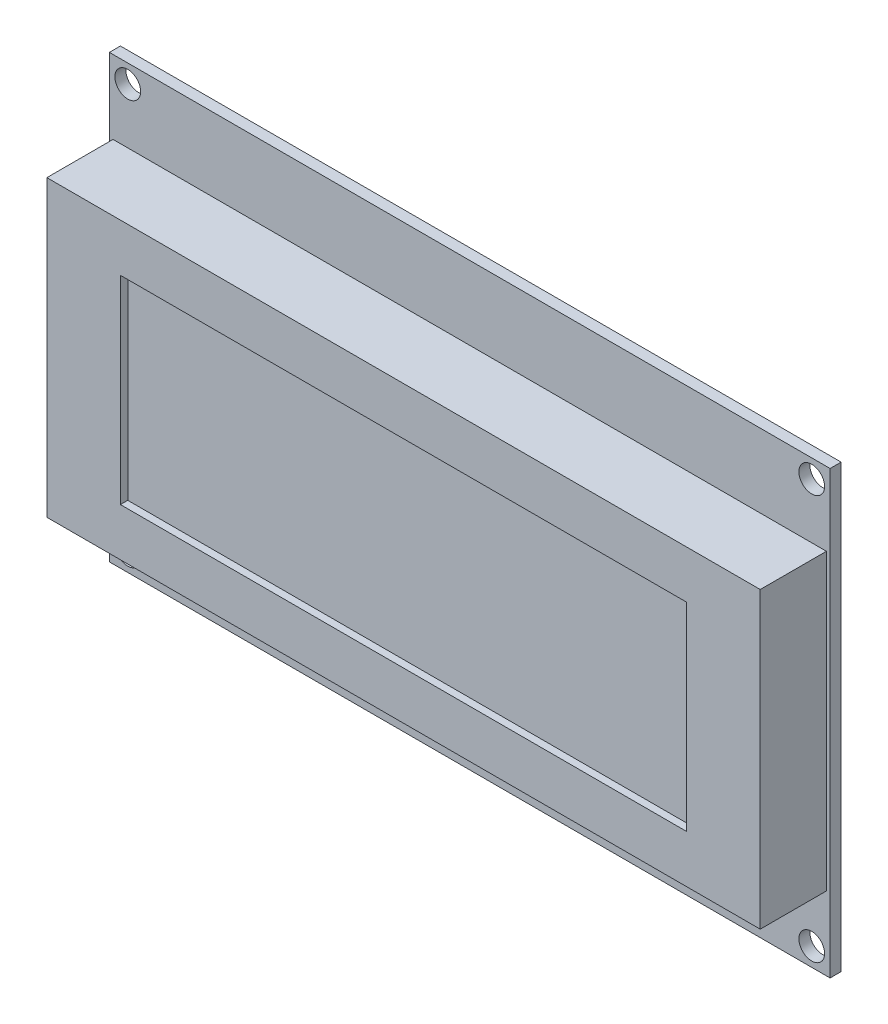
ISO-10303-21;
HEADER;
FILE_DESCRIPTION(('STEP AP214'),'2;1');
FILE_NAME('part.step','',(''),(''),'','','');
FILE_SCHEMA(('AUTOMOTIVE_DESIGN { 1 0 10303 214 1 1 1 1 }'));
ENDSEC;
DATA;
#1=APPLICATION_CONTEXT('core data for automotive mechanical design processes');
#2=APPLICATION_PROTOCOL_DEFINITION('international standard','automotive_design',2000,#1);
#3=PRODUCT_CONTEXT('',#1,'mechanical');
#4=PRODUCT('Part','Part','',(#3));
#5=PRODUCT_RELATED_PRODUCT_CATEGORY('part','',(#4));
#6=PRODUCT_DEFINITION_FORMATION('','',#4);
#7=PRODUCT_DEFINITION_CONTEXT('part definition',#1,'design');
#8=PRODUCT_DEFINITION('design','',#6,#7);
#9=PRODUCT_DEFINITION_SHAPE('','',#8);
#10=(LENGTH_UNIT() NAMED_UNIT(*) SI_UNIT(.MILLI.,.METRE.));
#11=(NAMED_UNIT(*) PLANE_ANGLE_UNIT() SI_UNIT($,.RADIAN.));
#12=(NAMED_UNIT(*) SI_UNIT($,.STERADIAN.) SOLID_ANGLE_UNIT());
#13=UNCERTAINTY_MEASURE_WITH_UNIT(LENGTH_MEASURE(1.E-05),#10,'distance_accuracy_value','');
#14=(GEOMETRIC_REPRESENTATION_CONTEXT(3) GLOBAL_UNCERTAINTY_ASSIGNED_CONTEXT((#13)) GLOBAL_UNIT_ASSIGNED_CONTEXT((#10,
#11,#12)) REPRESENTATION_CONTEXT('',''));
#15=CARTESIAN_POINT('',(0.,0.,0.));
#16=DIRECTION('',(0.,0.,1.));
#17=DIRECTION('',(1.,0.,0.));
#18=AXIS2_PLACEMENT_3D('',#15,#16,#17);
#19=CARTESIAN_POINT('',(49.,30.,1.5));
#20=DIRECTION('',(-1.,0.,0.));
#21=DIRECTION('',(0.,-1.,0.));
#22=AXIS2_PLACEMENT_3D('',#19,#20,#21);
#23=PLANE('',#22);
#24=DIRECTION('',(0.,0.,-1.));
#25=VECTOR('',#24,1.);
#26=CARTESIAN_POINT('',(49.,30.,1.5));
#27=LINE('',#26,#25);
#28=CARTESIAN_POINT('',(49.,30.,1.5));
#29=VERTEX_POINT('',#28);
#30=CARTESIAN_POINT('',(49.,30.,0.));
#31=VERTEX_POINT('',#30);
#32=EDGE_CURVE('E206',#29,#31,#27,.T.);
#33=ORIENTED_EDGE('',*,*,#32,.F.);
#34=DIRECTION('',(0.,1.,0.));
#35=VECTOR('',#34,1.);
#36=CARTESIAN_POINT('',(49.,30.,1.5));
#37=LINE('',#36,#35);
#38=CARTESIAN_POINT('',(49.,-30.,1.5));
#39=VERTEX_POINT('',#38);
#40=EDGE_CURVE('E180',#39,#29,#37,.T.);
#41=ORIENTED_EDGE('',*,*,#40,.F.);
#42=DIRECTION('',(0.,0.,-1.));
#43=VECTOR('',#42,1.);
#44=CARTESIAN_POINT('',(49.,-30.,1.5));
#45=LINE('',#44,#43);
#46=CARTESIAN_POINT('',(49.,-30.,0.));
#47=VERTEX_POINT('',#46);
#48=EDGE_CURVE('E189',#39,#47,#45,.T.);
#49=ORIENTED_EDGE('',*,*,#48,.T.);
#50=DIRECTION('',(0.,1.,0.));
#51=VECTOR('',#50,1.);
#52=CARTESIAN_POINT('',(49.,30.,0.));
#53=LINE('',#52,#51);
#54=EDGE_CURVE('E190',#47,#31,#53,.T.);
#55=ORIENTED_EDGE('',*,*,#54,.T.);
#56=EDGE_LOOP('',(#33,#41,#49,#55));
#57=FACE_BOUND('',#56,.T.);
#58=ADVANCED_FACE('F39',(#57),#23,.F.);
#59=CARTESIAN_POINT('',(-49.,30.,1.5));
#60=DIRECTION('',(1.,0.,0.));
#61=DIRECTION('',(0.,0.,-1.));
#62=AXIS2_PLACEMENT_3D('',#59,#60,#61);
#63=PLANE('',#62);
#64=DIRECTION('',(0.,0.,-1.));
#65=VECTOR('',#64,1.);
#66=CARTESIAN_POINT('',(-49.,-30.,1.5));
#67=LINE('',#66,#65);
#68=CARTESIAN_POINT('',(-49.,-30.,1.5));
#69=VERTEX_POINT('',#68);
#70=CARTESIAN_POINT('',(-49.,-30.,0.));
#71=VERTEX_POINT('',#70);
#72=EDGE_CURVE('E200',#69,#71,#67,.T.);
#73=ORIENTED_EDGE('',*,*,#72,.F.);
#74=DIRECTION('',(0.,-1.,0.));
#75=VECTOR('',#74,1.);
#76=CARTESIAN_POINT('',(-49.,30.,1.5));
#77=LINE('',#76,#75);
#78=CARTESIAN_POINT('',(-49.,30.,1.5));
#79=VERTEX_POINT('',#78);
#80=EDGE_CURVE('E185',#79,#69,#77,.T.);
#81=ORIENTED_EDGE('',*,*,#80,.F.);
#82=DIRECTION('',(0.,0.,-1.));
#83=VECTOR('',#82,1.);
#84=CARTESIAN_POINT('',(-49.,30.,1.5));
#85=LINE('',#84,#83);
#86=CARTESIAN_POINT('',(-49.,30.,0.));
#87=VERTEX_POINT('',#86);
#88=EDGE_CURVE('E203',#79,#87,#85,.T.);
#89=ORIENTED_EDGE('',*,*,#88,.T.);
#90=DIRECTION('',(0.,-1.,0.));
#91=VECTOR('',#90,1.);
#92=CARTESIAN_POINT('',(-49.,30.,0.));
#93=LINE('',#92,#91);
#94=EDGE_CURVE('E195',#87,#71,#93,.T.);
#95=ORIENTED_EDGE('',*,*,#94,.T.);
#96=EDGE_LOOP('',(#73,#81,#89,#95));
#97=FACE_BOUND('',#96,.T.);
#98=ADVANCED_FACE('F314',(#97),#63,.F.);
#99=CARTESIAN_POINT('',(0.,0.,0.));
#100=DIRECTION('',(0.,0.,1.));
#101=DIRECTION('',(1.,0.,0.));
#102=AXIS2_PLACEMENT_3D('',#99,#100,#101);
#103=PLANE('',#102);
#104=ORIENTED_EDGE('',*,*,#54,.F.);
#105=DIRECTION('',(1.,0.,0.));
#106=VECTOR('',#105,1.);
#107=CARTESIAN_POINT('',(-49.,-30.,0.));
#108=LINE('',#107,#106);
#109=EDGE_CURVE('E183',#71,#47,#108,.T.);
#110=ORIENTED_EDGE('',*,*,#109,.F.);
#111=ORIENTED_EDGE('',*,*,#94,.F.);
#112=DIRECTION('',(-1.,0.,0.));
#113=VECTOR('',#112,1.);
#114=CARTESIAN_POINT('',(-49.,30.,0.));
#115=LINE('',#114,#113);
#116=EDGE_CURVE('E193',#31,#87,#115,.T.);
#117=ORIENTED_EDGE('',*,*,#116,.F.);
#118=EDGE_LOOP('',(#104,#110,#111,#117));
#119=FACE_BOUND('',#118,.T.);
#120=CARTESIAN_POINT('',(-46.5,27.5,0.));
#121=DIRECTION('',(0.,0.,1.));
#122=DIRECTION('',(1.,0.,0.));
#123=AXIS2_PLACEMENT_3D('',#120,#121,#122);
#124=CIRCLE('',#123,1.75);
#125=CARTESIAN_POINT('',(-44.75,27.5,0.));
#126=VERTEX_POINT('',#125);
#127=EDGE_CURVE('E235',#126,#126,#124,.T.);
#128=ORIENTED_EDGE('',*,*,#127,.T.);
#129=EDGE_LOOP('',(#128));
#130=FACE_BOUND('',#129,.T.);
#131=CARTESIAN_POINT('',(46.5,27.5,0.));
#132=DIRECTION('',(0.,0.,1.));
#133=DIRECTION('',(1.,0.,0.));
#134=AXIS2_PLACEMENT_3D('',#131,#132,#133);
#135=CIRCLE('',#134,1.75000000000001);
#136=CARTESIAN_POINT('',(48.25,27.5,0.));
#137=VERTEX_POINT('',#136);
#138=EDGE_CURVE('E249',#137,#137,#135,.T.);
#139=ORIENTED_EDGE('',*,*,#138,.T.);
#140=EDGE_LOOP('',(#139));
#141=FACE_BOUND('',#140,.T.);
#142=CARTESIAN_POINT('',(46.5,-27.5,0.));
#143=DIRECTION('',(0.,0.,1.));
#144=DIRECTION('',(1.,0.,0.));
#145=AXIS2_PLACEMENT_3D('',#142,#143,#144);
#146=CIRCLE('',#145,1.75);
#147=CARTESIAN_POINT('',(48.25,-27.5,0.));
#148=VERTEX_POINT('',#147);
#149=EDGE_CURVE('E262',#148,#148,#146,.T.);
#150=ORIENTED_EDGE('',*,*,#149,.T.);
#151=EDGE_LOOP('',(#150));
#152=FACE_BOUND('',#151,.T.);
#153=CARTESIAN_POINT('',(-46.5,-27.5,0.));
#154=DIRECTION('',(0.,0.,1.));
#155=DIRECTION('',(1.,0.,0.));
#156=AXIS2_PLACEMENT_3D('',#153,#154,#155);
#157=CIRCLE('',#156,1.75);
#158=CARTESIAN_POINT('',(-44.75,-27.5,0.));
#159=VERTEX_POINT('',#158);
#160=EDGE_CURVE('E255',#159,#159,#157,.T.);
#161=ORIENTED_EDGE('',*,*,#160,.T.);
#162=EDGE_LOOP('',(#161));
#163=FACE_BOUND('',#162,.T.);
#164=DIRECTION('',(0.,-1.,0.));
#165=VECTOR('',#164,1.);
#166=CARTESIAN_POINT('',(40.,-28.,0.));
#167=LINE('',#166,#165);
#168=CARTESIAN_POINT('',(40.,-8.,0.));
#169=VERTEX_POINT('',#168);
#170=CARTESIAN_POINT('',(40.,-28.,0.));
#171=VERTEX_POINT('',#170);
#172=EDGE_CURVE('E292',#169,#171,#167,.T.);
#173=ORIENTED_EDGE('',*,*,#172,.F.);
#174=DIRECTION('',(1.,0.,0.));
#175=VECTOR('',#174,1.);
#176=CARTESIAN_POINT('',(40.,-8.,0.));
#177=LINE('',#176,#175);
#178=CARTESIAN_POINT('',(-1.99999999999999,-8.,0.));
#179=VERTEX_POINT('',#178);
#180=EDGE_CURVE('E282',#179,#169,#177,.T.);
#181=ORIENTED_EDGE('',*,*,#180,.F.);
#182=DIRECTION('',(0.,1.,0.));
#183=VECTOR('',#182,1.);
#184=CARTESIAN_POINT('',(-1.99999999999999,-28.,0.));
#185=LINE('',#184,#183);
#186=CARTESIAN_POINT('',(-1.99999999999999,-28.,0.));
#187=VERTEX_POINT('',#186);
#188=EDGE_CURVE('E286',#187,#179,#185,.T.);
#189=ORIENTED_EDGE('',*,*,#188,.F.);
#190=DIRECTION('',(-1.,0.,0.));
#191=VECTOR('',#190,1.);
#192=CARTESIAN_POINT('',(40.,-28.,0.));
#193=LINE('',#192,#191);
#194=EDGE_CURVE('E289',#171,#187,#193,.T.);
#195=ORIENTED_EDGE('',*,*,#194,.F.);
#196=EDGE_LOOP('',(#173,#181,#189,#195));
#197=FACE_BOUND('',#196,.T.);
#198=ADVANCED_FACE('F319',(#119,#130,#141,#152,#163,#197),#103,.F.);
#199=CARTESIAN_POINT('',(-49.,30.,1.5));
#200=DIRECTION('',(0.,-1.,0.));
#201=DIRECTION('',(0.,0.,-1.));
#202=AXIS2_PLACEMENT_3D('',#199,#200,#201);
#203=PLANE('',#202);
#204=ORIENTED_EDGE('',*,*,#116,.T.);
#205=ORIENTED_EDGE('',*,*,#88,.F.);
#206=DIRECTION('',(-1.,0.,0.));
#207=VECTOR('',#206,1.);
#208=CARTESIAN_POINT('',(-49.,30.,1.5));
#209=LINE('',#208,#207);
#210=EDGE_CURVE('E182',#29,#79,#209,.T.);
#211=ORIENTED_EDGE('',*,*,#210,.F.);
#212=ORIENTED_EDGE('',*,*,#32,.T.);
#213=EDGE_LOOP('',(#204,#205,#211,#212));
#214=FACE_BOUND('',#213,.T.);
#215=ADVANCED_FACE('F327',(#214),#203,.F.);
#216=CARTESIAN_POINT('',(-49.,-30.,1.5));
#217=DIRECTION('',(0.,1.,0.));
#218=DIRECTION('',(0.,0.,1.));
#219=AXIS2_PLACEMENT_3D('',#216,#217,#218);
#220=PLANE('',#219);
#221=ORIENTED_EDGE('',*,*,#109,.T.);
#222=ORIENTED_EDGE('',*,*,#48,.F.);
#223=DIRECTION('',(1.,0.,0.));
#224=VECTOR('',#223,1.);
#225=CARTESIAN_POINT('',(-49.,-30.,1.5));
#226=LINE('',#225,#224);
#227=EDGE_CURVE('E187',#69,#39,#226,.T.);
#228=ORIENTED_EDGE('',*,*,#227,.F.);
#229=ORIENTED_EDGE('',*,*,#72,.T.);
#230=EDGE_LOOP('',(#221,#222,#228,#229));
#231=FACE_BOUND('',#230,.T.);
#232=ADVANCED_FACE('F335',(#231),#220,.F.);
#233=CARTESIAN_POINT('',(0.,0.,1.5));
#234=DIRECTION('',(0.,0.,1.));
#235=DIRECTION('',(1.,0.,0.));
#236=AXIS2_PLACEMENT_3D('',#233,#234,#235);
#237=PLANE('',#236);
#238=ORIENTED_EDGE('',*,*,#80,.T.);
#239=ORIENTED_EDGE('',*,*,#227,.T.);
#240=ORIENTED_EDGE('',*,*,#40,.T.);
#241=ORIENTED_EDGE('',*,*,#210,.T.);
#242=EDGE_LOOP('',(#238,#239,#240,#241));
#243=FACE_BOUND('',#242,.T.);
#244=DIRECTION('',(-1.,0.,0.));
#245=VECTOR('',#244,1.);
#246=CARTESIAN_POINT('',(-49.,20.,1.5));
#247=LINE('',#246,#245);
#248=CARTESIAN_POINT('',(48.5,20.,1.5));
#249=VERTEX_POINT('',#248);
#250=CARTESIAN_POINT('',(-48.5,20.,1.5));
#251=VERTEX_POINT('',#250);
#252=EDGE_CURVE('E166',#249,#251,#247,.T.);
#253=ORIENTED_EDGE('',*,*,#252,.F.);
#254=DIRECTION('',(0.,1.,0.));
#255=VECTOR('',#254,1.);
#256=CARTESIAN_POINT('',(48.5,-22.8772475942832,1.5));
#257=LINE('',#256,#255);
#258=CARTESIAN_POINT('',(48.5,-20.,1.5));
#259=VERTEX_POINT('',#258);
#260=EDGE_CURVE('E151',#259,#249,#257,.T.);
#261=ORIENTED_EDGE('',*,*,#260,.F.);
#262=DIRECTION('',(1.,0.,0.));
#263=VECTOR('',#262,1.);
#264=CARTESIAN_POINT('',(-49.,-20.,1.5));
#265=LINE('',#264,#263);
#266=CARTESIAN_POINT('',(-48.5,-20.,1.5));
#267=VERTEX_POINT('',#266);
#268=EDGE_CURVE('E164',#267,#259,#265,.T.);
#269=ORIENTED_EDGE('',*,*,#268,.F.);
#270=DIRECTION('',(0.,-1.,0.));
#271=VECTOR('',#270,1.);
#272=CARTESIAN_POINT('',(-48.5,-21.5579745302687,1.5));
#273=LINE('',#272,#271);
#274=EDGE_CURVE('E167',#251,#267,#273,.T.);
#275=ORIENTED_EDGE('',*,*,#274,.F.);
#276=EDGE_LOOP('',(#253,#261,#269,#275));
#277=FACE_BOUND('',#276,.T.);
#278=CARTESIAN_POINT('',(-46.5,-27.5,1.5));
#279=DIRECTION('',(0.,0.,1.));
#280=DIRECTION('',(1.,0.,0.));
#281=AXIS2_PLACEMENT_3D('',#278,#279,#280);
#282=CIRCLE('',#281,1.75);
#283=CARTESIAN_POINT('',(-44.75,-27.5,1.5));
#284=VERTEX_POINT('',#283);
#285=EDGE_CURVE('E252',#284,#284,#282,.T.);
#286=ORIENTED_EDGE('',*,*,#285,.F.);
#287=EDGE_LOOP('',(#286));
#288=FACE_BOUND('',#287,.T.);
#289=CARTESIAN_POINT('',(46.5,-27.5,1.5));
#290=DIRECTION('',(0.,0.,1.));
#291=DIRECTION('',(1.,0.,0.));
#292=AXIS2_PLACEMENT_3D('',#289,#290,#291);
#293=CIRCLE('',#292,1.75);
#294=CARTESIAN_POINT('',(48.25,-27.5,1.5));
#295=VERTEX_POINT('',#294);
#296=EDGE_CURVE('E259',#295,#295,#293,.T.);
#297=ORIENTED_EDGE('',*,*,#296,.F.);
#298=EDGE_LOOP('',(#297));
#299=FACE_BOUND('',#298,.T.);
#300=CARTESIAN_POINT('',(46.5,27.5,1.5));
#301=DIRECTION('',(0.,0.,1.));
#302=DIRECTION('',(1.,0.,0.));
#303=AXIS2_PLACEMENT_3D('',#300,#301,#302);
#304=CIRCLE('',#303,1.75000000000001);
#305=CARTESIAN_POINT('',(48.25,27.5,1.5));
#306=VERTEX_POINT('',#305);
#307=EDGE_CURVE('E265',#306,#306,#304,.T.);
#308=ORIENTED_EDGE('',*,*,#307,.F.);
#309=EDGE_LOOP('',(#308));
#310=FACE_BOUND('',#309,.T.);
#311=CARTESIAN_POINT('',(-46.5,27.5,1.5));
#312=DIRECTION('',(0.,0.,1.));
#313=DIRECTION('',(1.,0.,0.));
#314=AXIS2_PLACEMENT_3D('',#311,#312,#313);
#315=CIRCLE('',#314,1.75);
#316=CARTESIAN_POINT('',(-44.75,27.5,1.5));
#317=VERTEX_POINT('',#316);
#318=EDGE_CURVE('E246',#317,#317,#315,.T.);
#319=ORIENTED_EDGE('',*,*,#318,.F.);
#320=EDGE_LOOP('',(#319));
#321=FACE_BOUND('',#320,.T.);
#322=ADVANCED_FACE('F161',(#243,#277,#288,#299,#310,#321),#237,.T.);
#323=CARTESIAN_POINT('',(-49.,-20.,10.5));
#324=DIRECTION('',(0.,1.,0.));
#325=DIRECTION('',(-1.,0.,0.));
#326=AXIS2_PLACEMENT_3D('',#323,#324,#325);
#327=PLANE('',#326);
#328=DIRECTION('',(1.,0.,0.));
#329=VECTOR('',#328,1.);
#330=CARTESIAN_POINT('',(-49.,-20.,10.5));
#331=LINE('',#330,#329);
#332=CARTESIAN_POINT('',(-48.5,-20.,10.5));
#333=VERTEX_POINT('',#332);
#334=CARTESIAN_POINT('',(48.5,-20.,10.5));
#335=VERTEX_POINT('',#334);
#336=EDGE_CURVE('E172',#333,#335,#331,.T.);
#337=ORIENTED_EDGE('',*,*,#336,.F.);
#338=DIRECTION('',(0.,0.,-1.));
#339=VECTOR('',#338,1.);
#340=CARTESIAN_POINT('',(-48.5,-20.,10.5));
#341=LINE('',#340,#339);
#342=EDGE_CURVE('E61',#333,#267,#341,.T.);
#343=ORIENTED_EDGE('',*,*,#342,.T.);
#344=ORIENTED_EDGE('',*,*,#268,.T.);
#345=DIRECTION('',(0.,0.,1.));
#346=VECTOR('',#345,1.);
#347=CARTESIAN_POINT('',(48.5,-20.,10.5));
#348=LINE('',#347,#346);
#349=EDGE_CURVE('E148',#259,#335,#348,.T.);
#350=ORIENTED_EDGE('',*,*,#349,.T.);
#351=EDGE_LOOP('',(#337,#343,#344,#350));
#352=FACE_BOUND('',#351,.T.);
#353=ADVANCED_FACE('F169',(#352),#327,.F.);
#354=CARTESIAN_POINT('',(-49.,20.,10.5));
#355=DIRECTION('',(0.,-1.,0.));
#356=DIRECTION('',(0.,0.,-1.));
#357=AXIS2_PLACEMENT_3D('',#354,#355,#356);
#358=PLANE('',#357);
#359=ORIENTED_EDGE('',*,*,#252,.T.);
#360=DIRECTION('',(0.,0.,1.));
#361=VECTOR('',#360,1.);
#362=CARTESIAN_POINT('',(-48.5,20.,10.5));
#363=LINE('',#362,#361);
#364=CARTESIAN_POINT('',(-48.5,20.,10.5));
#365=VERTEX_POINT('',#364);
#366=EDGE_CURVE('E156',#251,#365,#363,.T.);
#367=ORIENTED_EDGE('',*,*,#366,.T.);
#368=DIRECTION('',(-1.,0.,0.));
#369=VECTOR('',#368,1.);
#370=CARTESIAN_POINT('',(-49.,20.,10.5));
#371=LINE('',#370,#369);
#372=CARTESIAN_POINT('',(48.5,20.,10.5));
#373=VERTEX_POINT('',#372);
#374=EDGE_CURVE('E177',#373,#365,#371,.T.);
#375=ORIENTED_EDGE('',*,*,#374,.F.);
#376=DIRECTION('',(0.,0.,-1.));
#377=VECTOR('',#376,1.);
#378=CARTESIAN_POINT('',(48.5,20.,10.5));
#379=LINE('',#378,#377);
#380=EDGE_CURVE('E53',#373,#249,#379,.T.);
#381=ORIENTED_EDGE('',*,*,#380,.T.);
#382=EDGE_LOOP('',(#359,#367,#375,#381));
#383=FACE_BOUND('',#382,.T.);
#384=ADVANCED_FACE('F214',(#383),#358,.F.);
#385=CARTESIAN_POINT('',(0.,0.,10.5));
#386=DIRECTION('',(0.,0.,-1.));
#387=DIRECTION('',(-1.,0.,0.));
#388=AXIS2_PLACEMENT_3D('',#385,#386,#387);
#389=PLANE('',#388);
#390=DIRECTION('',(-1.,0.,0.));
#391=VECTOR('',#390,1.);
#392=CARTESIAN_POINT('',(-38.5,13.5,10.5));
#393=LINE('',#392,#391);
#394=CARTESIAN_POINT('',(38.5,13.5,10.5));
#395=VERTEX_POINT('',#394);
#396=CARTESIAN_POINT('',(-38.5,13.5,10.5));
#397=VERTEX_POINT('',#396);
#398=EDGE_CURVE('E230',#395,#397,#393,.T.);
#399=ORIENTED_EDGE('',*,*,#398,.F.);
#400=DIRECTION('',(0.,1.,0.));
#401=VECTOR('',#400,1.);
#402=CARTESIAN_POINT('',(38.5,13.5,10.5));
#403=LINE('',#402,#401);
#404=CARTESIAN_POINT('',(38.5,-13.5,10.5));
#405=VERTEX_POINT('',#404);
#406=EDGE_CURVE('E233',#405,#395,#403,.T.);
#407=ORIENTED_EDGE('',*,*,#406,.F.);
#408=DIRECTION('',(1.,0.,0.));
#409=VECTOR('',#408,1.);
#410=CARTESIAN_POINT('',(-38.5,-13.5,10.5));
#411=LINE('',#410,#409);
#412=CARTESIAN_POINT('',(-38.5,-13.5,10.5));
#413=VERTEX_POINT('',#412);
#414=EDGE_CURVE('E223',#413,#405,#411,.T.);
#415=ORIENTED_EDGE('',*,*,#414,.F.);
#416=DIRECTION('',(0.,-1.,0.));
#417=VECTOR('',#416,1.);
#418=CARTESIAN_POINT('',(-38.5,13.5,10.5));
#419=LINE('',#418,#417);
#420=EDGE_CURVE('E227',#397,#413,#419,.T.);
#421=ORIENTED_EDGE('',*,*,#420,.F.);
#422=EDGE_LOOP('',(#399,#407,#415,#421));
#423=FACE_BOUND('',#422,.T.);
#424=ORIENTED_EDGE('',*,*,#374,.T.);
#425=DIRECTION('',(0.,-1.,0.));
#426=VECTOR('',#425,1.);
#427=CARTESIAN_POINT('',(-48.5,0.,10.5));
#428=LINE('',#427,#426);
#429=EDGE_CURVE('E11',#365,#333,#428,.T.);
#430=ORIENTED_EDGE('',*,*,#429,.T.);
#431=ORIENTED_EDGE('',*,*,#336,.T.);
#432=DIRECTION('',(0.,1.,0.));
#433=VECTOR('',#432,1.);
#434=CARTESIAN_POINT('',(48.5,0.,10.5));
#435=LINE('',#434,#433);
#436=EDGE_CURVE('E46',#335,#373,#435,.T.);
#437=ORIENTED_EDGE('',*,*,#436,.T.);
#438=EDGE_LOOP('',(#424,#430,#431,#437));
#439=FACE_BOUND('',#438,.T.);
#440=ADVANCED_FACE('F211',(#423,#439),#389,.F.);
#441=CARTESIAN_POINT('',(38.5,13.5,9.5));
#442=DIRECTION('',(1.,0.,0.));
#443=DIRECTION('',(0.,0.,-1.));
#444=AXIS2_PLACEMENT_3D('',#441,#442,#443);
#445=PLANE('',#444);
#446=ORIENTED_EDGE('',*,*,#406,.T.);
#447=DIRECTION('',(0.,0.,1.));
#448=VECTOR('',#447,1.);
#449=CARTESIAN_POINT('',(38.5,13.5,9.5));
#450=LINE('',#449,#448);
#451=CARTESIAN_POINT('',(38.5,13.5,9.5));
#452=VERTEX_POINT('',#451);
#453=EDGE_CURVE('E216',#452,#395,#450,.T.);
#454=ORIENTED_EDGE('',*,*,#453,.F.);
#455=DIRECTION('',(0.,1.,0.));
#456=VECTOR('',#455,1.);
#457=CARTESIAN_POINT('',(38.5,13.5,9.5));
#458=LINE('',#457,#456);
#459=CARTESIAN_POINT('',(38.5,-13.5,9.5));
#460=VERTEX_POINT('',#459);
#461=EDGE_CURVE('E226',#460,#452,#458,.T.);
#462=ORIENTED_EDGE('',*,*,#461,.F.);
#463=DIRECTION('',(0.,0.,1.));
#464=VECTOR('',#463,1.);
#465=CARTESIAN_POINT('',(38.5,-13.5,9.5));
#466=LINE('',#465,#464);
#467=EDGE_CURVE('E170',#460,#405,#466,.T.);
#468=ORIENTED_EDGE('',*,*,#467,.T.);
#469=EDGE_LOOP('',(#446,#454,#462,#468));
#470=FACE_BOUND('',#469,.T.);
#471=ADVANCED_FACE('F401',(#470),#445,.F.);
#472=CARTESIAN_POINT('',(-38.5,-13.5,9.5));
#473=DIRECTION('',(0.,-1.,0.));
#474=DIRECTION('',(0.,0.,-1.));
#475=AXIS2_PLACEMENT_3D('',#472,#473,#474);
#476=PLANE('',#475);
#477=ORIENTED_EDGE('',*,*,#414,.T.);
#478=ORIENTED_EDGE('',*,*,#467,.F.);
#479=DIRECTION('',(1.,0.,0.));
#480=VECTOR('',#479,1.);
#481=CARTESIAN_POINT('',(-38.5,-13.5,9.5));
#482=LINE('',#481,#480);
#483=CARTESIAN_POINT('',(-38.5,-13.5,9.5));
#484=VERTEX_POINT('',#483);
#485=EDGE_CURVE('E220',#484,#460,#482,.T.);
#486=ORIENTED_EDGE('',*,*,#485,.F.);
#487=DIRECTION('',(0.,0.,1.));
#488=VECTOR('',#487,1.);
#489=CARTESIAN_POINT('',(-38.5,-13.5,9.5));
#490=LINE('',#489,#488);
#491=EDGE_CURVE('E174',#484,#413,#490,.T.);
#492=ORIENTED_EDGE('',*,*,#491,.T.);
#493=EDGE_LOOP('',(#477,#478,#486,#492));
#494=FACE_BOUND('',#493,.T.);
#495=ADVANCED_FACE('F397',(#494),#476,.F.);
#496=CARTESIAN_POINT('',(-38.5,13.5,9.5));
#497=DIRECTION('',(-1.,0.,0.));
#498=DIRECTION('',(0.,0.,1.));
#499=AXIS2_PLACEMENT_3D('',#496,#497,#498);
#500=PLANE('',#499);
#501=ORIENTED_EDGE('',*,*,#420,.T.);
#502=ORIENTED_EDGE('',*,*,#491,.F.);
#503=DIRECTION('',(0.,-1.,0.));
#504=VECTOR('',#503,1.);
#505=CARTESIAN_POINT('',(-38.5,13.5,9.5));
#506=LINE('',#505,#504);
#507=CARTESIAN_POINT('',(-38.5,13.5,9.5));
#508=VERTEX_POINT('',#507);
#509=EDGE_CURVE('E238',#508,#484,#506,.T.);
#510=ORIENTED_EDGE('',*,*,#509,.F.);
#511=DIRECTION('',(0.,0.,1.));
#512=VECTOR('',#511,1.);
#513=CARTESIAN_POINT('',(-38.5,13.5,9.5));
#514=LINE('',#513,#512);
#515=EDGE_CURVE('E219',#508,#397,#514,.T.);
#516=ORIENTED_EDGE('',*,*,#515,.T.);
#517=EDGE_LOOP('',(#501,#502,#510,#516));
#518=FACE_BOUND('',#517,.T.);
#519=ADVANCED_FACE('F400',(#518),#500,.F.);
#520=CARTESIAN_POINT('',(-38.5,13.5,9.5));
#521=DIRECTION('',(0.,1.,0.));
#522=DIRECTION('',(0.,0.,1.));
#523=AXIS2_PLACEMENT_3D('',#520,#521,#522);
#524=PLANE('',#523);
#525=ORIENTED_EDGE('',*,*,#398,.T.);
#526=ORIENTED_EDGE('',*,*,#515,.F.);
#527=DIRECTION('',(-1.,0.,0.));
#528=VECTOR('',#527,1.);
#529=CARTESIAN_POINT('',(-38.5,13.5,9.5));
#530=LINE('',#529,#528);
#531=EDGE_CURVE('E241',#452,#508,#530,.T.);
#532=ORIENTED_EDGE('',*,*,#531,.F.);
#533=ORIENTED_EDGE('',*,*,#453,.T.);
#534=EDGE_LOOP('',(#525,#526,#532,#533));
#535=FACE_BOUND('',#534,.T.);
#536=ADVANCED_FACE('F395',(#535),#524,.F.);
#537=CARTESIAN_POINT('',(0.,0.,9.5));
#538=DIRECTION('',(0.,0.,1.));
#539=DIRECTION('',(1.,0.,0.));
#540=AXIS2_PLACEMENT_3D('',#537,#538,#539);
#541=PLANE('',#540);
#542=ORIENTED_EDGE('',*,*,#461,.T.);
#543=ORIENTED_EDGE('',*,*,#531,.T.);
#544=ORIENTED_EDGE('',*,*,#509,.T.);
#545=ORIENTED_EDGE('',*,*,#485,.T.);
#546=EDGE_LOOP('',(#542,#543,#544,#545));
#547=FACE_BOUND('',#546,.T.);
#548=ADVANCED_FACE('F391',(#547),#541,.T.);
#549=CARTESIAN_POINT('',(-46.5,27.5,0.));
#550=DIRECTION('',(0.,0.,1.));
#551=DIRECTION('',(1.,0.,0.));
#552=AXIS2_PLACEMENT_3D('',#549,#550,#551);
#553=CYLINDRICAL_SURFACE('',#552,1.75);
#554=ORIENTED_EDGE('',*,*,#127,.F.);
#555=EDGE_LOOP('',(#554));
#556=FACE_BOUND('',#555,.T.);
#557=ORIENTED_EDGE('',*,*,#318,.T.);
#558=EDGE_LOOP('',(#557));
#559=FACE_BOUND('',#558,.T.);
#560=ADVANCED_FACE('F381',(#556,#559),#553,.F.);
#561=CARTESIAN_POINT('',(46.5,27.5,0.));
#562=DIRECTION('',(0.,0.,1.));
#563=DIRECTION('',(1.,0.,0.));
#564=AXIS2_PLACEMENT_3D('',#561,#562,#563);
#565=CYLINDRICAL_SURFACE('',#564,1.75000000000001);
#566=ORIENTED_EDGE('',*,*,#138,.F.);
#567=EDGE_LOOP('',(#566));
#568=FACE_BOUND('',#567,.T.);
#569=ORIENTED_EDGE('',*,*,#307,.T.);
#570=EDGE_LOOP('',(#569));
#571=FACE_BOUND('',#570,.T.);
#572=ADVANCED_FACE('F377',(#568,#571),#565,.F.);
#573=CARTESIAN_POINT('',(46.5,-27.5,0.));
#574=DIRECTION('',(0.,0.,1.));
#575=DIRECTION('',(1.,0.,0.));
#576=AXIS2_PLACEMENT_3D('',#573,#574,#575);
#577=CYLINDRICAL_SURFACE('',#576,1.75);
#578=ORIENTED_EDGE('',*,*,#149,.F.);
#579=EDGE_LOOP('',(#578));
#580=FACE_BOUND('',#579,.T.);
#581=ORIENTED_EDGE('',*,*,#296,.T.);
#582=EDGE_LOOP('',(#581));
#583=FACE_BOUND('',#582,.T.);
#584=ADVANCED_FACE('F380',(#580,#583),#577,.F.);
#585=CARTESIAN_POINT('',(-46.5,-27.5,0.));
#586=DIRECTION('',(0.,0.,1.));
#587=DIRECTION('',(1.,0.,0.));
#588=AXIS2_PLACEMENT_3D('',#585,#586,#587);
#589=CYLINDRICAL_SURFACE('',#588,1.75);
#590=ORIENTED_EDGE('',*,*,#160,.F.);
#591=EDGE_LOOP('',(#590));
#592=FACE_BOUND('',#591,.T.);
#593=ORIENTED_EDGE('',*,*,#285,.T.);
#594=EDGE_LOOP('',(#593));
#595=FACE_BOUND('',#594,.T.);
#596=ADVANCED_FACE('F373',(#592,#595),#589,.F.);
#597=CARTESIAN_POINT('',(40.,-28.,-9.));
#598=DIRECTION('',(-1.,0.,0.));
#599=DIRECTION('',(0.,0.,1.));
#600=AXIS2_PLACEMENT_3D('',#597,#598,#599);
#601=PLANE('',#600);
#602=ORIENTED_EDGE('',*,*,#172,.T.);
#603=DIRECTION('',(0.,0.,1.));
#604=VECTOR('',#603,1.);
#605=CARTESIAN_POINT('',(40.,-28.,-9.));
#606=LINE('',#605,#604);
#607=CARTESIAN_POINT('',(40.,-28.,-9.));
#608=VERTEX_POINT('',#607);
#609=EDGE_CURVE('E256',#608,#171,#606,.T.);
#610=ORIENTED_EDGE('',*,*,#609,.F.);
#611=DIRECTION('',(0.,-1.,0.));
#612=VECTOR('',#611,1.);
#613=CARTESIAN_POINT('',(40.,-28.,-9.));
#614=LINE('',#613,#612);
#615=CARTESIAN_POINT('',(40.,-8.,-9.));
#616=VERTEX_POINT('',#615);
#617=EDGE_CURVE('E285',#616,#608,#614,.T.);
#618=ORIENTED_EDGE('',*,*,#617,.F.);
#619=DIRECTION('',(0.,0.,1.));
#620=VECTOR('',#619,1.);
#621=CARTESIAN_POINT('',(40.,-8.,-9.));
#622=LINE('',#621,#620);
#623=EDGE_CURVE('E278',#616,#169,#622,.T.);
#624=ORIENTED_EDGE('',*,*,#623,.T.);
#625=EDGE_LOOP('',(#602,#610,#618,#624));
#626=FACE_BOUND('',#625,.T.);
#627=ADVANCED_FACE('F358',(#626),#601,.F.);
#628=CARTESIAN_POINT('',(40.,-28.,-9.));
#629=DIRECTION('',(0.,1.,0.));
#630=DIRECTION('',(0.,0.,1.));
#631=AXIS2_PLACEMENT_3D('',#628,#629,#630);
#632=PLANE('',#631);
#633=ORIENTED_EDGE('',*,*,#194,.T.);
#634=DIRECTION('',(0.,0.,1.));
#635=VECTOR('',#634,1.);
#636=CARTESIAN_POINT('',(-1.99999999999999,-28.,-9.));
#637=LINE('',#636,#635);
#638=CARTESIAN_POINT('',(-1.99999999999999,-28.,-9.));
#639=VERTEX_POINT('',#638);
#640=EDGE_CURVE('E272',#639,#187,#637,.T.);
#641=ORIENTED_EDGE('',*,*,#640,.F.);
#642=DIRECTION('',(-1.,0.,0.));
#643=VECTOR('',#642,1.);
#644=CARTESIAN_POINT('',(40.,-28.,-9.));
#645=LINE('',#644,#643);
#646=EDGE_CURVE('E298',#608,#639,#645,.T.);
#647=ORIENTED_EDGE('',*,*,#646,.F.);
#648=ORIENTED_EDGE('',*,*,#609,.T.);
#649=EDGE_LOOP('',(#633,#641,#647,#648));
#650=FACE_BOUND('',#649,.T.);
#651=ADVANCED_FACE('F365',(#650),#632,.F.);
#652=CARTESIAN_POINT('',(-1.99999999999999,-28.,-9.));
#653=DIRECTION('',(1.,0.,0.));
#654=DIRECTION('',(0.,0.,-1.));
#655=AXIS2_PLACEMENT_3D('',#652,#653,#654);
#656=PLANE('',#655);
#657=ORIENTED_EDGE('',*,*,#188,.T.);
#658=DIRECTION('',(0.,0.,1.));
#659=VECTOR('',#658,1.);
#660=CARTESIAN_POINT('',(-1.99999999999999,-8.,-9.));
#661=LINE('',#660,#659);
#662=CARTESIAN_POINT('',(-1.99999999999999,-8.,-9.));
#663=VERTEX_POINT('',#662);
#664=EDGE_CURVE('E275',#663,#179,#661,.T.);
#665=ORIENTED_EDGE('',*,*,#664,.F.);
#666=DIRECTION('',(0.,1.,0.));
#667=VECTOR('',#666,1.);
#668=CARTESIAN_POINT('',(-1.99999999999999,-28.,-9.));
#669=LINE('',#668,#667);
#670=EDGE_CURVE('E296',#639,#663,#669,.T.);
#671=ORIENTED_EDGE('',*,*,#670,.F.);
#672=ORIENTED_EDGE('',*,*,#640,.T.);
#673=EDGE_LOOP('',(#657,#665,#671,#672));
#674=FACE_BOUND('',#673,.T.);
#675=ADVANCED_FACE('F363',(#674),#656,.F.);
#676=CARTESIAN_POINT('',(40.,-8.,-9.));
#677=DIRECTION('',(0.,-1.,0.));
#678=DIRECTION('',(0.,0.,-1.));
#679=AXIS2_PLACEMENT_3D('',#676,#677,#678);
#680=PLANE('',#679);
#681=ORIENTED_EDGE('',*,*,#180,.T.);
#682=ORIENTED_EDGE('',*,*,#623,.F.);
#683=DIRECTION('',(1.,0.,0.));
#684=VECTOR('',#683,1.);
#685=CARTESIAN_POINT('',(40.,-8.,-9.));
#686=LINE('',#685,#684);
#687=EDGE_CURVE('E281',#663,#616,#686,.T.);
#688=ORIENTED_EDGE('',*,*,#687,.F.);
#689=ORIENTED_EDGE('',*,*,#664,.T.);
#690=EDGE_LOOP('',(#681,#682,#688,#689));
#691=FACE_BOUND('',#690,.T.);
#692=ADVANCED_FACE('F354',(#691),#680,.F.);
#693=CARTESIAN_POINT('',(0.,0.,-9.));
#694=DIRECTION('',(0.,0.,1.));
#695=DIRECTION('',(1.,0.,0.));
#696=AXIS2_PLACEMENT_3D('',#693,#694,#695);
#697=PLANE('',#696);
#698=ORIENTED_EDGE('',*,*,#617,.T.);
#699=ORIENTED_EDGE('',*,*,#646,.T.);
#700=ORIENTED_EDGE('',*,*,#670,.T.);
#701=ORIENTED_EDGE('',*,*,#687,.T.);
#702=EDGE_LOOP('',(#698,#699,#700,#701));
#703=FACE_BOUND('',#702,.T.);
#704=ADVANCED_FACE('F311',(#703),#697,.F.);
#705=CARTESIAN_POINT('',(48.5,-22.8772475942832,-46.8905979137333));
#706=DIRECTION('',(-1.,0.,0.));
#707=DIRECTION('',(0.,0.,1.));
#708=AXIS2_PLACEMENT_3D('',#705,#706,#707);
#709=PLANE('',#708);
#710=ORIENTED_EDGE('',*,*,#260,.T.);
#711=ORIENTED_EDGE('',*,*,#380,.F.);
#712=ORIENTED_EDGE('',*,*,#436,.F.);
#713=ORIENTED_EDGE('',*,*,#349,.F.);
#714=EDGE_LOOP('',(#710,#711,#712,#713));
#715=FACE_BOUND('',#714,.T.);
#716=ADVANCED_FACE('F150',(#715),#709,.F.);
#717=CARTESIAN_POINT('',(-48.5,-21.5579745302687,-46.8905979137333));
#718=DIRECTION('',(1.,0.,0.));
#719=DIRECTION('',(0.,0.,-1.));
#720=AXIS2_PLACEMENT_3D('',#717,#718,#719);
#721=PLANE('',#720);
#722=ORIENTED_EDGE('',*,*,#429,.F.);
#723=ORIENTED_EDGE('',*,*,#366,.F.);
#724=ORIENTED_EDGE('',*,*,#274,.T.);
#725=ORIENTED_EDGE('',*,*,#342,.F.);
#726=EDGE_LOOP('',(#722,#723,#724,#725));
#727=FACE_BOUND('',#726,.T.);
#728=ADVANCED_FACE('F305',(#727),#721,.F.);
#729=CLOSED_SHELL('',(#58,#98,#198,#215,#232,#322,#353,#384,#440,#471,#495,#519,#536,#548,#560,
#572,#584,#596,#627,#651,#675,#692,#704,#716,#728));
#730=MANIFOLD_SOLID_BREP('B2',#729);
#731=ADVANCED_BREP_SHAPE_REPRESENTATION('',(#18,#730),#14);
#732=SHAPE_DEFINITION_REPRESENTATION(#9,#731);
ENDSEC;
END-ISO-10303-21;
